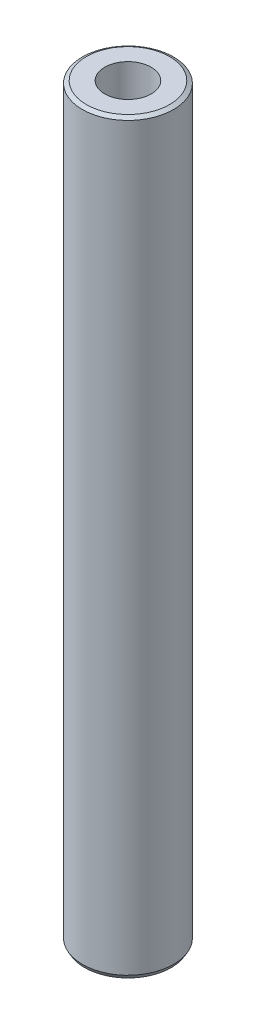
ISO-10303-21;
HEADER;
FILE_DESCRIPTION(('STEP AP214'),'2;1');
FILE_NAME('part.step','',(''),(''),'','','');
FILE_SCHEMA(('AUTOMOTIVE_DESIGN { 1 0 10303 214 1 1 1 1 }'));
ENDSEC;
DATA;
#1=APPLICATION_CONTEXT('core data for automotive mechanical design processes');
#2=APPLICATION_PROTOCOL_DEFINITION('international standard','automotive_design',2000,#1);
#3=PRODUCT_CONTEXT('',#1,'mechanical');
#4=PRODUCT('Part','Part','',(#3));
#5=PRODUCT_RELATED_PRODUCT_CATEGORY('part','',(#4));
#6=PRODUCT_DEFINITION_FORMATION('','',#4);
#7=PRODUCT_DEFINITION_CONTEXT('part definition',#1,'design');
#8=PRODUCT_DEFINITION('design','',#6,#7);
#9=PRODUCT_DEFINITION_SHAPE('','',#8);
#10=(LENGTH_UNIT() NAMED_UNIT(*) SI_UNIT(.MILLI.,.METRE.));
#11=(NAMED_UNIT(*) PLANE_ANGLE_UNIT() SI_UNIT($,.RADIAN.));
#12=(NAMED_UNIT(*) SI_UNIT($,.STERADIAN.) SOLID_ANGLE_UNIT());
#13=UNCERTAINTY_MEASURE_WITH_UNIT(LENGTH_MEASURE(1.E-05),#10,'distance_accuracy_value','');
#14=(GEOMETRIC_REPRESENTATION_CONTEXT(3) GLOBAL_UNCERTAINTY_ASSIGNED_CONTEXT((#13)) GLOBAL_UNIT_ASSIGNED_CONTEXT((#10,
#11,#12)) REPRESENTATION_CONTEXT('',''));
#15=CARTESIAN_POINT('',(0.,0.,0.));
#16=DIRECTION('',(0.,0.,1.));
#17=DIRECTION('',(1.,0.,0.));
#18=AXIS2_PLACEMENT_3D('',#15,#16,#17);
#19=CARTESIAN_POINT('',(0.,163.77208138074,0.));
#20=DIRECTION('',(0.,-1.,0.));
#21=DIRECTION('',(0.,0.,-1.));
#22=AXIS2_PLACEMENT_3D('',#19,#20,#21);
#23=CYLINDRICAL_SURFACE('',#22,10.);
#24=CARTESIAN_POINT('',(0.,163.267588604951,0.));
#25=DIRECTION('',(0.,1.,0.));
#26=DIRECTION('',(0.,0.,1.));
#27=AXIS2_PLACEMENT_3D('',#24,#25,#26);
#28=CIRCLE('',#27,10.);
#29=CARTESIAN_POINT('',(0.,163.267588604951,10.));
#30=VERTEX_POINT('',#29);
#31=EDGE_CURVE('E50',#30,#30,#28,.F.);
#32=ORIENTED_EDGE('',*,*,#31,.T.);
#33=EDGE_LOOP('',(#32));
#34=FACE_BOUND('',#33,.T.);
#35=CARTESIAN_POINT('',(0.,0.87380711971724,0.));
#36=DIRECTION('',(0.,1.,0.));
#37=DIRECTION('',(0.,0.,1.));
#38=AXIS2_PLACEMENT_3D('',#35,#36,#37);
#39=CIRCLE('',#38,10.);
#40=CARTESIAN_POINT('',(0.,0.87380711971724,10.));
#41=VERTEX_POINT('',#40);
#42=EDGE_CURVE('E51',#41,#41,#39,.T.);
#43=ORIENTED_EDGE('',*,*,#42,.T.);
#44=EDGE_LOOP('',(#43));
#45=FACE_BOUND('',#44,.T.);
#46=ADVANCED_FACE('F39',(#34,#45),#23,.T.);
#47=CARTESIAN_POINT('',(0.,163.77208138074,0.));
#48=DIRECTION('',(0.,1.,0.));
#49=DIRECTION('',(0.,0.,1.));
#50=AXIS2_PLACEMENT_3D('',#47,#48,#49);
#51=PLANE('',#50);
#52=CARTESIAN_POINT('',(0.,163.77208138074,0.));
#53=DIRECTION('',(0.,1.,0.));
#54=DIRECTION('',(0.,0.,1.));
#55=AXIS2_PLACEMENT_3D('',#52,#53,#54);
#56=CIRCLE('',#55,9.12619288028277);
#57=CARTESIAN_POINT('',(0.,163.77208138074,9.12619288028277));
#58=VERTEX_POINT('',#57);
#59=EDGE_CURVE('E54',#58,#58,#56,.T.);
#60=ORIENTED_EDGE('',*,*,#59,.T.);
#61=EDGE_LOOP('',(#60));
#62=FACE_BOUND('',#61,.T.);
#63=CARTESIAN_POINT('',(0.,163.77208138074,0.));
#64=DIRECTION('',(0.,1.,0.));
#65=DIRECTION('',(0.,0.,1.));
#66=AXIS2_PLACEMENT_3D('',#63,#64,#65);
#67=CIRCLE('',#66,5.09163940105452);
#68=CARTESIAN_POINT('',(0.,163.77208138074,5.09163940105452));
#69=VERTEX_POINT('',#68);
#70=EDGE_CURVE('E58',#69,#69,#67,.T.);
#71=ORIENTED_EDGE('',*,*,#70,.F.);
#72=EDGE_LOOP('',(#71));
#73=FACE_BOUND('',#72,.T.);
#74=ADVANCED_FACE('F69',(#62,#73),#51,.T.);
#75=CARTESIAN_POINT('',(0.,0.,0.));
#76=DIRECTION('',(0.,1.,0.));
#77=DIRECTION('',(0.,0.,1.));
#78=AXIS2_PLACEMENT_3D('',#75,#76,#77);
#79=PLANE('',#78);
#80=CARTESIAN_POINT('',(0.,0.,0.));
#81=DIRECTION('',(0.,1.,0.));
#82=DIRECTION('',(0.,0.,1.));
#83=AXIS2_PLACEMENT_3D('',#80,#81,#82);
#84=CIRCLE('',#83,9.49550722421144);
#85=CARTESIAN_POINT('',(0.,0.,9.49550722421144));
#86=VERTEX_POINT('',#85);
#87=EDGE_CURVE('E10',#86,#86,#84,.F.);
#88=ORIENTED_EDGE('',*,*,#87,.T.);
#89=EDGE_LOOP('',(#88));
#90=FACE_BOUND('',#89,.T.);
#91=CARTESIAN_POINT('',(0.,0.,0.));
#92=DIRECTION('',(0.,1.,0.));
#93=DIRECTION('',(0.,0.,1.));
#94=AXIS2_PLACEMENT_3D('',#91,#92,#93);
#95=CIRCLE('',#94,5.09163940105452);
#96=CARTESIAN_POINT('',(0.,0.,5.09163940105452));
#97=VERTEX_POINT('',#96);
#98=EDGE_CURVE('E63',#97,#97,#95,.T.);
#99=ORIENTED_EDGE('',*,*,#98,.T.);
#100=EDGE_LOOP('',(#99));
#101=FACE_BOUND('',#100,.T.);
#102=ADVANCED_FACE('F75',(#90,#101),#79,.F.);
#103=CARTESIAN_POINT('',(0.,163.77208138074,0.));
#104=DIRECTION('',(0.,-1.,0.));
#105=DIRECTION('',(0.,0.,-1.));
#106=AXIS2_PLACEMENT_3D('',#103,#104,#105);
#107=CYLINDRICAL_SURFACE('',#106,5.09163940105452);
#108=ORIENTED_EDGE('',*,*,#70,.T.);
#109=EDGE_LOOP('',(#108));
#110=FACE_BOUND('',#109,.T.);
#111=ORIENTED_EDGE('',*,*,#98,.F.);
#112=EDGE_LOOP('',(#111));
#113=FACE_BOUND('',#112,.T.);
#114=ADVANCED_FACE('F70',(#110,#113),#107,.F.);
#115=CARTESIAN_POINT('',(0.,163.77208138074,0.));
#116=DIRECTION('',(0.,-1.,0.));
#117=DIRECTION('',(0.,0.,-1.));
#118=AXIS2_PLACEMENT_3D('',#115,#116,#117);
#119=CONICAL_SURFACE('',#118,9.12619288028277,1.04719755119659);
#120=ORIENTED_EDGE('',*,*,#31,.F.);
#121=EDGE_LOOP('',(#120));
#122=FACE_BOUND('',#121,.T.);
#123=ORIENTED_EDGE('',*,*,#59,.F.);
#124=EDGE_LOOP('',(#123));
#125=FACE_BOUND('',#124,.T.);
#126=ADVANCED_FACE('F81',(#122,#125),#119,.T.);
#127=CARTESIAN_POINT('',(0.,0.87380711971724,0.));
#128=DIRECTION('',(0.,1.,0.));
#129=DIRECTION('',(0.,0.,1.));
#130=AXIS2_PLACEMENT_3D('',#127,#128,#129);
#131=CONICAL_SURFACE('',#130,10.,0.523598775598298);
#132=CARTESIAN_POINT('',(0.,0.,9.49550722421144));
#133=CARTESIAN_POINT('',(0.,0.00910215749705467,9.50076235729257));
#134=CARTESIAN_POINT('',(0.,0.0182043149941092,9.5060174903737));
#135=CARTESIAN_POINT('',(0.,0.0364086299882182,9.51652775653596));
#136=CARTESIAN_POINT('',(0.,0.0455107874852727,9.5217828896171));
#137=CARTESIAN_POINT('',(0.,0.0637151024793819,9.53229315577936));
#138=CARTESIAN_POINT('',(0.,0.0728172599764367,9.53754828886049));
#139=CARTESIAN_POINT('',(0.,0.0910215749705459,9.54805855502275));
#140=CARTESIAN_POINT('',(0.,0.1001237324676,9.55331368810388));
#141=CARTESIAN_POINT('',(0.,0.118328047461709,9.56382395426614));
#142=CARTESIAN_POINT('',(0.,0.127430204958764,9.56907908734727));
#143=CARTESIAN_POINT('',(0.,0.145634519952873,9.57958935350953));
#144=CARTESIAN_POINT('',(0.,0.154736677449928,9.58484448659067));
#145=CARTESIAN_POINT('',(0.,0.172940992444037,9.59535475275293));
#146=CARTESIAN_POINT('',(0.,0.182043149941092,9.60060988583406));
#147=CARTESIAN_POINT('',(0.,0.200247464935201,9.61112015199632));
#148=CARTESIAN_POINT('',(0.,0.209349622432255,9.61637528507745));
#149=CARTESIAN_POINT('',(0.,0.227553937426365,9.62688555123971));
#150=CARTESIAN_POINT('',(0.,0.236656094923419,9.63214068432084));
#151=CARTESIAN_POINT('',(0.,0.254860409917528,9.64265095048311));
#152=CARTESIAN_POINT('',(0.,0.263962567414583,9.64790608356424));
#153=CARTESIAN_POINT('',(0.,0.282166882408692,9.6584163497265));
#154=CARTESIAN_POINT('',(0.,0.291269039905747,9.66367148280763));
#155=CARTESIAN_POINT('',(0.,0.309473354899856,9.67418174896989));
#156=CARTESIAN_POINT('',(0.,0.31857551239691,9.67943688205102));
#157=CARTESIAN_POINT('',(0.,0.33677982739102,9.68994714821328));
#158=CARTESIAN_POINT('',(0.,0.345881984888074,9.69520228129441));
#159=CARTESIAN_POINT('',(0.,0.364086299882183,9.70571254745667));
#160=CARTESIAN_POINT('',(0.,0.373188457379238,9.71096768053781));
#161=CARTESIAN_POINT('',(0.,0.391392772373347,9.72147794670007));
#162=CARTESIAN_POINT('',(0.,0.400494929870402,9.7267330797812));
#163=CARTESIAN_POINT('',(0.,0.418699244864511,9.73724334594346));
#164=CARTESIAN_POINT('',(0.,0.427801402361566,9.74249847902459));
#165=CARTESIAN_POINT('',(0.,0.446005717355675,9.75300874518685));
#166=CARTESIAN_POINT('',(0.,0.455107874852729,9.75826387826798));
#167=CARTESIAN_POINT('',(0.,0.473312189846838,9.76877414443024));
#168=CARTESIAN_POINT('',(0.,0.482414347343893,9.77402927751137));
#169=CARTESIAN_POINT('',(0.,0.500618662338002,9.78453954367364));
#170=CARTESIAN_POINT('',(0.,0.509720819835057,9.78979467675477));
#171=CARTESIAN_POINT('',(0.,0.527925134829166,9.80030494291703));
#172=CARTESIAN_POINT('',(0.,0.537027292326221,9.80556007599816));
#173=CARTESIAN_POINT('',(0.,0.55523160732033,9.81607034216042));
#174=CARTESIAN_POINT('',(0.,0.564333764817384,9.82132547524155));
#175=CARTESIAN_POINT('',(0.,0.582538079811494,9.83183574140381));
#176=CARTESIAN_POINT('',(0.,0.591640237308548,9.83709087448495));
#177=CARTESIAN_POINT('',(0.,0.609844552302657,9.84760114064721));
#178=CARTESIAN_POINT('',(0.,0.618946709799712,9.85285627372834));
#179=CARTESIAN_POINT('',(0.,0.637151024793821,9.8633665398906));
#180=CARTESIAN_POINT('',(0.,0.646253182290876,9.86862167297173));
#181=CARTESIAN_POINT('',(0.,0.664457497284985,9.87913193913399));
#182=CARTESIAN_POINT('',(0.,0.673559654782039,9.88438707221512));
#183=CARTESIAN_POINT('',(0.,0.691763969776149,9.89489733837738));
#184=CARTESIAN_POINT('',(0.,0.700866127273203,9.90015247145852));
#185=CARTESIAN_POINT('',(0.,0.719070442267312,9.91066273762078));
#186=CARTESIAN_POINT('',(0.,0.728172599764367,9.91591787070191));
#187=CARTESIAN_POINT('',(0.,0.746376914758476,9.92642813686417));
#188=CARTESIAN_POINT('',(0.,0.75547907225553,9.9316832699453));
#189=CARTESIAN_POINT('',(0.,0.77368338724964,9.94219353610756));
#190=CARTESIAN_POINT('',(0.,0.782785544746694,9.94744866918869));
#191=CARTESIAN_POINT('',(0.,0.800989859740804,9.95795893535095));
#192=CARTESIAN_POINT('',(0.,0.810092017237858,9.96321406843208));
#193=CARTESIAN_POINT('',(0.,0.828296332231967,9.97372433459435));
#194=CARTESIAN_POINT('',(0.,0.837398489729022,9.97897946767548));
#195=CARTESIAN_POINT('',(0.,0.855602804723131,9.98948973383774));
#196=CARTESIAN_POINT('',(0.,0.864704962220186,9.99474486691887));
#197=CARTESIAN_POINT('',(0.,0.87380711971724,10.));
#198=B_SPLINE_CURVE_WITH_KNOTS('',3,(#132,#133,#134,#135,#136,#137,#138,#139,#140,#141,#142,
#143,#144,#145,#146,#147,#148,#149,#150,#151,#152,#153,#154,#155,#156,#157,#158,#159,#160,#161,
#162,#163,#164,#165,#166,#167,#168,#169,#170,#171,#172,#173,#174,#175,#176,#177,#178,#179,#180,
#181,#182,#183,#184,#185,#186,#187,#188,#189,#190,#191,#192,#193,#194,#195,#196,#197),
.UNSPECIFIED.,.F.,.F.,(4,2,2,2,2,2,2,2,2,2,2,2,2,2,2,2,2,2,2,2,2,2,2,2,2,2,2,2,2,2,2,2,4),(0.,
0.0315307984867851,0.0630615969735703,0.0945923954603545,0.12612319394714,0.157653992433925,
0.18918479092071,0.220715589407495,0.25224638789428,0.283777186381065,0.31530798486785,
0.346838783354635,0.37836958184142,0.409900380328205,0.44143117881499,0.472961977301775,
0.50449277578856,0.536023574275345,0.56755437276213,0.599085171248915,0.6306159697357,
0.662146768222486,0.693677566709271,0.725208365196055,0.75673916368284,0.788269962169625,
0.81980076065641,0.851331559143195,0.882862357629981,0.914393156116765,0.94592395460355,
0.977454753090335,1.00898555157712),.UNSPECIFIED.);
#199=EDGE_CURVE('BSEAM45',#86,#41,#198,.T.);
#200=ORIENTED_EDGE('',*,*,#87,.F.);
#201=ORIENTED_EDGE('',*,*,#42,.F.);
#202=ORIENTED_EDGE('',*,*,#199,.T.);
#203=ORIENTED_EDGE('',*,*,#199,.F.);
#204=EDGE_LOOP('',(#200,#202,#201,#203));
#205=FACE_BOUND('',#204,.T.);
#206=ADVANCED_FACE('F45',(#205),#131,.T.);
#207=CLOSED_SHELL('',(#46,#74,#102,#114,#126,#206));
#208=MANIFOLD_SOLID_BREP('B2',#207);
#209=ADVANCED_BREP_SHAPE_REPRESENTATION('',(#18,#208),#14);
#210=SHAPE_DEFINITION_REPRESENTATION(#9,#209);
ENDSEC;
END-ISO-10303-21;
